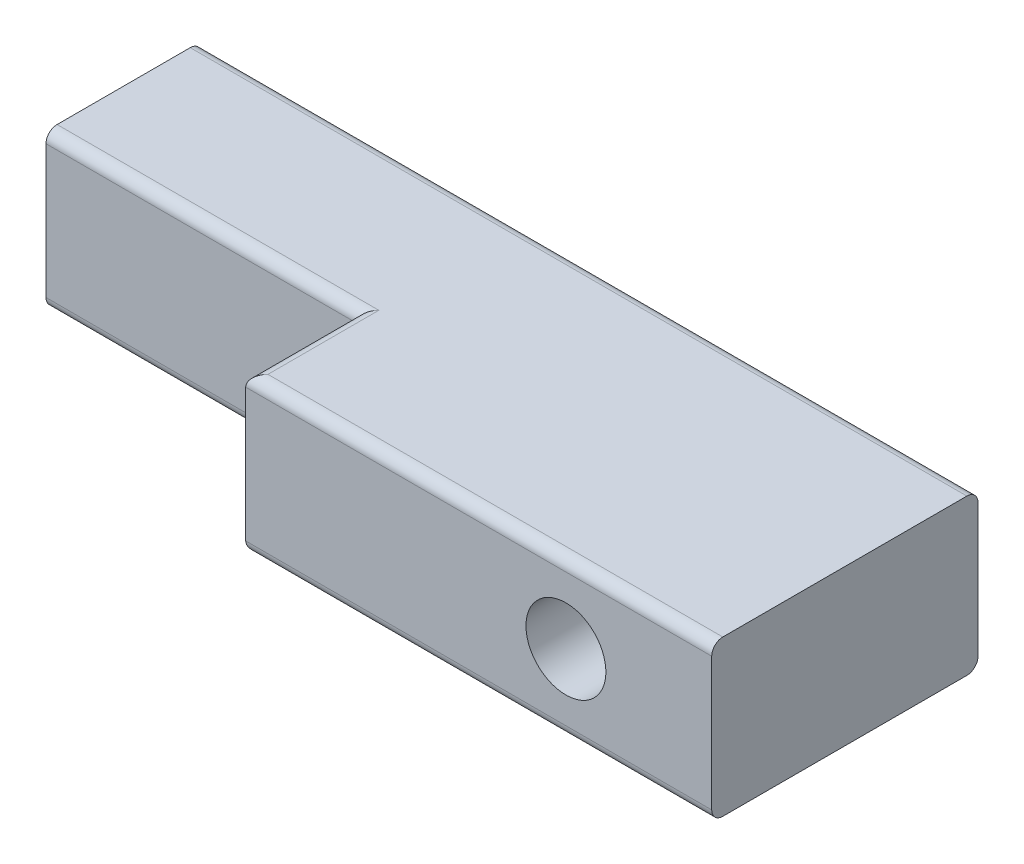
ISO-10303-21;
HEADER;
FILE_DESCRIPTION(('STEP AP214'),'2;1');
FILE_NAME('part.step','',(''),(''),'','','');
FILE_SCHEMA(('AUTOMOTIVE_DESIGN { 1 0 10303 214 1 1 1 1 }'));
ENDSEC;
DATA;
#1=APPLICATION_CONTEXT('core data for automotive mechanical design processes');
#2=APPLICATION_PROTOCOL_DEFINITION('international standard','automotive_design',2000,#1);
#3=PRODUCT_CONTEXT('',#1,'mechanical');
#4=PRODUCT('Part','Part','',(#3));
#5=PRODUCT_RELATED_PRODUCT_CATEGORY('part','',(#4));
#6=PRODUCT_DEFINITION_FORMATION('','',#4);
#7=PRODUCT_DEFINITION_CONTEXT('part definition',#1,'design');
#8=PRODUCT_DEFINITION('design','',#6,#7);
#9=PRODUCT_DEFINITION_SHAPE('','',#8);
#10=(LENGTH_UNIT() NAMED_UNIT(*) SI_UNIT(.MILLI.,.METRE.));
#11=(NAMED_UNIT(*) PLANE_ANGLE_UNIT() SI_UNIT($,.RADIAN.));
#12=(NAMED_UNIT(*) SI_UNIT($,.STERADIAN.) SOLID_ANGLE_UNIT());
#13=UNCERTAINTY_MEASURE_WITH_UNIT(LENGTH_MEASURE(1.E-05),#10,'distance_accuracy_value','');
#14=(GEOMETRIC_REPRESENTATION_CONTEXT(3) GLOBAL_UNCERTAINTY_ASSIGNED_CONTEXT((#13)) GLOBAL_UNIT_ASSIGNED_CONTEXT((#10,
#11,#12)) REPRESENTATION_CONTEXT('',''));
#15=CARTESIAN_POINT('',(0.,0.,0.));
#16=DIRECTION('',(0.,0.,1.));
#17=DIRECTION('',(1.,0.,0.));
#18=AXIS2_PLACEMENT_3D('',#15,#16,#17);
#19=CARTESIAN_POINT('',(0.,0.,7.));
#20=DIRECTION('',(0.,0.,-1.));
#21=DIRECTION('',(-1.,0.,0.));
#22=AXIS2_PLACEMENT_3D('',#19,#20,#21);
#23=PLANE('',#22);
#24=DIRECTION('',(0.,-1.,0.));
#25=VECTOR('',#24,1.);
#26=CARTESIAN_POINT('',(-17.5,-3.5,7.));
#27=LINE('',#26,#25);
#28=CARTESIAN_POINT('',(-17.5,3.,7.));
#29=VERTEX_POINT('',#28);
#30=CARTESIAN_POINT('',(-17.5,-3.,7.));
#31=VERTEX_POINT('',#30);
#32=EDGE_CURVE('E179',#29,#31,#27,.T.);
#33=ORIENTED_EDGE('',*,*,#32,.T.);
#34=DIRECTION('',(1.,0.,0.));
#35=VECTOR('',#34,1.);
#36=CARTESIAN_POINT('',(0.,-3.,7.));
#37=LINE('',#36,#35);
#38=CARTESIAN_POINT('',(-3.5,-3.,7.));
#39=VERTEX_POINT('',#38);
#40=EDGE_CURVE('E152',#31,#39,#37,.T.);
#41=ORIENTED_EDGE('',*,*,#40,.T.);
#42=DIRECTION('',(0.,-1.,0.));
#43=VECTOR('',#42,1.);
#44=CARTESIAN_POINT('',(-3.5,3.5,7.));
#45=LINE('',#44,#43);
#46=CARTESIAN_POINT('',(-3.5,3.,7.));
#47=VERTEX_POINT('',#46);
#48=EDGE_CURVE('E159',#47,#39,#45,.T.);
#49=ORIENTED_EDGE('',*,*,#48,.F.);
#50=DIRECTION('',(-1.,0.,0.));
#51=VECTOR('',#50,1.);
#52=CARTESIAN_POINT('',(0.,3.,7.));
#53=LINE('',#52,#51);
#54=EDGE_CURVE('E144',#47,#29,#53,.T.);
#55=ORIENTED_EDGE('',*,*,#54,.T.);
#56=EDGE_LOOP('',(#33,#41,#49,#55));
#57=FACE_BOUND('',#56,.T.);
#58=ADVANCED_FACE('F39',(#57),#23,.F.);
#59=CARTESIAN_POINT('',(17.5,-3.5,7.));
#60=DIRECTION('',(-1.,0.,0.));
#61=DIRECTION('',(0.,0.,1.));
#62=AXIS2_PLACEMENT_3D('',#59,#60,#61);
#63=PLANE('',#62);
#64=DIRECTION('',(0.,1.,0.));
#65=VECTOR('',#64,1.);
#66=CARTESIAN_POINT('',(17.5,3.5,12.));
#67=LINE('',#66,#65);
#68=CARTESIAN_POINT('',(17.5,-3.,12.));
#69=VERTEX_POINT('',#68);
#70=CARTESIAN_POINT('',(17.5,3.,12.));
#71=VERTEX_POINT('',#70);
#72=EDGE_CURVE('E170',#69,#71,#67,.T.);
#73=ORIENTED_EDGE('',*,*,#72,.F.);
#74=CARTESIAN_POINT('',(17.5,-3.,11.5));
#75=DIRECTION('',(-1.,0.,0.));
#76=DIRECTION('',(0.,0.,1.));
#77=AXIS2_PLACEMENT_3D('',#74,#75,#76);
#78=CIRCLE('',#77,0.5);
#79=CARTESIAN_POINT('',(17.5,-3.5,11.5));
#80=VERTEX_POINT('',#79);
#81=EDGE_CURVE('E257',#69,#80,#78,.F.);
#82=ORIENTED_EDGE('',*,*,#81,.T.);
#83=DIRECTION('',(0.,0.,-1.));
#84=VECTOR('',#83,1.);
#85=CARTESIAN_POINT('',(17.5,-3.5,7.));
#86=LINE('',#85,#84);
#87=CARTESIAN_POINT('',(17.5,-3.5,0.5));
#88=VERTEX_POINT('',#87);
#89=EDGE_CURVE('E182',#80,#88,#86,.T.);
#90=ORIENTED_EDGE('',*,*,#89,.T.);
#91=CARTESIAN_POINT('',(17.5,-3.,0.5));
#92=DIRECTION('',(-1.,0.,0.));
#93=DIRECTION('',(0.,0.,1.));
#94=AXIS2_PLACEMENT_3D('',#91,#92,#93);
#95=CIRCLE('',#94,0.5);
#96=CARTESIAN_POINT('',(17.5,-3.,0.));
#97=VERTEX_POINT('',#96);
#98=EDGE_CURVE('E63',#88,#97,#95,.F.);
#99=ORIENTED_EDGE('',*,*,#98,.T.);
#100=DIRECTION('',(0.,1.,0.));
#101=VECTOR('',#100,1.);
#102=CARTESIAN_POINT('',(17.5,-3.5,0.));
#103=LINE('',#102,#101);
#104=CARTESIAN_POINT('',(17.5,3.,0.));
#105=VERTEX_POINT('',#104);
#106=EDGE_CURVE('E184',#97,#105,#103,.T.);
#107=ORIENTED_EDGE('',*,*,#106,.T.);
#108=CARTESIAN_POINT('',(17.5,3.,0.5));
#109=DIRECTION('',(-1.,0.,0.));
#110=DIRECTION('',(0.,0.,1.));
#111=AXIS2_PLACEMENT_3D('',#108,#109,#110);
#112=CIRCLE('',#111,0.5);
#113=CARTESIAN_POINT('',(17.5,3.5,0.5));
#114=VERTEX_POINT('',#113);
#115=EDGE_CURVE('E249',#105,#114,#112,.F.);
#116=ORIENTED_EDGE('',*,*,#115,.T.);
#117=DIRECTION('',(0.,0.,-1.));
#118=VECTOR('',#117,1.);
#119=CARTESIAN_POINT('',(17.5,3.5,7.));
#120=LINE('',#119,#118);
#121=CARTESIAN_POINT('',(17.5,3.5,11.5));
#122=VERTEX_POINT('',#121);
#123=EDGE_CURVE('E200',#122,#114,#120,.T.);
#124=ORIENTED_EDGE('',*,*,#123,.F.);
#125=CARTESIAN_POINT('',(17.5,3.,11.5));
#126=DIRECTION('',(-1.,0.,0.));
#127=DIRECTION('',(0.,0.,1.));
#128=AXIS2_PLACEMENT_3D('',#125,#126,#127);
#129=CIRCLE('',#128,0.5);
#130=EDGE_CURVE('E254',#122,#71,#129,.F.);
#131=ORIENTED_EDGE('',*,*,#130,.T.);
#132=EDGE_LOOP('',(#73,#82,#90,#99,#107,#116,#124,#131));
#133=FACE_BOUND('',#132,.T.);
#134=ADVANCED_FACE('F308',(#133),#63,.F.);
#135=CARTESIAN_POINT('',(-17.5,3.5,7.));
#136=DIRECTION('',(0.,-1.,0.));
#137=DIRECTION('',(0.,0.,-1.));
#138=AXIS2_PLACEMENT_3D('',#135,#136,#137);
#139=PLANE('',#138);
#140=DIRECTION('',(0.,0.,-1.));
#141=VECTOR('',#140,1.);
#142=CARTESIAN_POINT('',(-17.5,3.5,7.));
#143=LINE('',#142,#141);
#144=CARTESIAN_POINT('',(-17.5,3.5,6.5));
#145=VERTEX_POINT('',#144);
#146=CARTESIAN_POINT('',(-17.5,3.5,0.5));
#147=VERTEX_POINT('',#146);
#148=EDGE_CURVE('E196',#145,#147,#143,.T.);
#149=ORIENTED_EDGE('',*,*,#148,.F.);
#150=DIRECTION('',(-1.,0.,0.));
#151=VECTOR('',#150,1.);
#152=CARTESIAN_POINT('',(-17.5,3.5,6.5));
#153=LINE('',#152,#151);
#154=CARTESIAN_POINT('',(-3.,3.5,6.5));
#155=VERTEX_POINT('',#154);
#156=EDGE_CURVE('E214',#145,#155,#153,.F.);
#157=ORIENTED_EDGE('',*,*,#156,.T.);
#158=DIRECTION('',(0.,0.,-1.));
#159=VECTOR('',#158,1.);
#160=CARTESIAN_POINT('',(-3.,3.5,7.));
#161=LINE('',#160,#159);
#162=CARTESIAN_POINT('',(-3.,3.5,11.5));
#163=VERTEX_POINT('',#162);
#164=EDGE_CURVE('E137',#155,#163,#161,.F.);
#165=ORIENTED_EDGE('',*,*,#164,.T.);
#166=DIRECTION('',(-1.,0.,0.));
#167=VECTOR('',#166,1.);
#168=CARTESIAN_POINT('',(-17.5,3.5,11.5));
#169=LINE('',#168,#167);
#170=EDGE_CURVE('E209',#163,#122,#169,.F.);
#171=ORIENTED_EDGE('',*,*,#170,.T.);
#172=ORIENTED_EDGE('',*,*,#123,.T.);
#173=DIRECTION('',(-1.,0.,0.));
#174=VECTOR('',#173,1.);
#175=CARTESIAN_POINT('',(-17.5,3.5,0.5));
#176=LINE('',#175,#174);
#177=EDGE_CURVE('E165',#114,#147,#176,.T.);
#178=ORIENTED_EDGE('',*,*,#177,.T.);
#179=EDGE_LOOP('',(#149,#157,#165,#171,#172,#178));
#180=FACE_BOUND('',#179,.T.);
#181=ADVANCED_FACE('F303',(#180),#139,.F.);
#182=CARTESIAN_POINT('',(-17.5,-3.5,7.));
#183=DIRECTION('',(1.,0.,0.));
#184=DIRECTION('',(0.,0.,-1.));
#185=AXIS2_PLACEMENT_3D('',#182,#183,#184);
#186=PLANE('',#185);
#187=DIRECTION('',(0.,0.,-1.));
#188=VECTOR('',#187,1.);
#189=CARTESIAN_POINT('',(-17.5,-3.5,7.));
#190=LINE('',#189,#188);
#191=CARTESIAN_POINT('',(-17.5,-3.5,6.5));
#192=VERTEX_POINT('',#191);
#193=CARTESIAN_POINT('',(-17.5,-3.5,0.5));
#194=VERTEX_POINT('',#193);
#195=EDGE_CURVE('E192',#192,#194,#190,.T.);
#196=ORIENTED_EDGE('',*,*,#195,.F.);
#197=CARTESIAN_POINT('',(-17.5,-3.,6.5));
#198=DIRECTION('',(1.,0.,0.));
#199=DIRECTION('',(0.,0.,-1.));
#200=AXIS2_PLACEMENT_3D('',#197,#198,#199);
#201=CIRCLE('',#200,0.5);
#202=EDGE_CURVE('E240',#192,#31,#201,.F.);
#203=ORIENTED_EDGE('',*,*,#202,.T.);
#204=ORIENTED_EDGE('',*,*,#32,.F.);
#205=CARTESIAN_POINT('',(-17.5,3.,6.5));
#206=DIRECTION('',(1.,0.,0.));
#207=DIRECTION('',(0.,0.,-1.));
#208=AXIS2_PLACEMENT_3D('',#205,#206,#207);
#209=CIRCLE('',#208,0.5);
#210=EDGE_CURVE('E146',#29,#145,#209,.F.);
#211=ORIENTED_EDGE('',*,*,#210,.T.);
#212=ORIENTED_EDGE('',*,*,#148,.T.);
#213=CARTESIAN_POINT('',(-17.5,3.,0.5));
#214=DIRECTION('',(1.,0.,0.));
#215=DIRECTION('',(0.,0.,-1.));
#216=AXIS2_PLACEMENT_3D('',#213,#214,#215);
#217=CIRCLE('',#216,0.5);
#218=CARTESIAN_POINT('',(-17.5,3.,0.));
#219=VERTEX_POINT('',#218);
#220=EDGE_CURVE('E232',#147,#219,#217,.F.);
#221=ORIENTED_EDGE('',*,*,#220,.T.);
#222=DIRECTION('',(0.,-1.,0.));
#223=VECTOR('',#222,1.);
#224=CARTESIAN_POINT('',(-17.5,-3.5,0.));
#225=LINE('',#224,#223);
#226=CARTESIAN_POINT('',(-17.5,-3.,0.));
#227=VERTEX_POINT('',#226);
#228=EDGE_CURVE('E183',#219,#227,#225,.T.);
#229=ORIENTED_EDGE('',*,*,#228,.T.);
#230=CARTESIAN_POINT('',(-17.5,-3.,0.5));
#231=DIRECTION('',(1.,0.,0.));
#232=DIRECTION('',(0.,0.,-1.));
#233=AXIS2_PLACEMENT_3D('',#230,#231,#232);
#234=CIRCLE('',#233,0.5);
#235=EDGE_CURVE('E235',#227,#194,#234,.F.);
#236=ORIENTED_EDGE('',*,*,#235,.T.);
#237=EDGE_LOOP('',(#196,#203,#204,#211,#212,#221,#229,#236));
#238=FACE_BOUND('',#237,.T.);
#239=ADVANCED_FACE('F295',(#238),#186,.F.);
#240=CARTESIAN_POINT('',(-17.5,-3.5,7.));
#241=DIRECTION('',(0.,1.,0.));
#242=DIRECTION('',(0.,0.,1.));
#243=AXIS2_PLACEMENT_3D('',#240,#241,#242);
#244=PLANE('',#243);
#245=DIRECTION('',(0.,0.,-1.));
#246=VECTOR('',#245,1.);
#247=CARTESIAN_POINT('',(-3.,-3.5,7.));
#248=LINE('',#247,#246);
#249=CARTESIAN_POINT('',(-3.,-3.5,11.5));
#250=VERTEX_POINT('',#249);
#251=CARTESIAN_POINT('',(-3.,-3.5,6.5));
#252=VERTEX_POINT('',#251);
#253=EDGE_CURVE('E224',#250,#252,#248,.T.);
#254=ORIENTED_EDGE('',*,*,#253,.T.);
#255=DIRECTION('',(1.,0.,0.));
#256=VECTOR('',#255,1.);
#257=CARTESIAN_POINT('',(-17.5,-3.5,6.5));
#258=LINE('',#257,#256);
#259=EDGE_CURVE('E153',#252,#192,#258,.F.);
#260=ORIENTED_EDGE('',*,*,#259,.T.);
#261=ORIENTED_EDGE('',*,*,#195,.T.);
#262=DIRECTION('',(1.,0.,0.));
#263=VECTOR('',#262,1.);
#264=CARTESIAN_POINT('',(17.5,-3.5,0.5));
#265=LINE('',#264,#263);
#266=EDGE_CURVE('E217',#194,#88,#265,.T.);
#267=ORIENTED_EDGE('',*,*,#266,.T.);
#268=ORIENTED_EDGE('',*,*,#89,.F.);
#269=DIRECTION('',(1.,0.,0.));
#270=VECTOR('',#269,1.);
#271=CARTESIAN_POINT('',(-17.5,-3.5,11.5));
#272=LINE('',#271,#270);
#273=EDGE_CURVE('E221',#80,#250,#272,.F.);
#274=ORIENTED_EDGE('',*,*,#273,.T.);
#275=EDGE_LOOP('',(#254,#260,#261,#267,#268,#274));
#276=FACE_BOUND('',#275,.T.);
#277=ADVANCED_FACE('F285',(#276),#244,.F.);
#278=CARTESIAN_POINT('',(0.,0.,0.));
#279=DIRECTION('',(0.,0.,-1.));
#280=DIRECTION('',(-1.,0.,0.));
#281=AXIS2_PLACEMENT_3D('',#278,#279,#280);
#282=PLANE('',#281);
#283=CARTESIAN_POINT('',(10.9295931048964,0.,0.));
#284=DIRECTION('',(0.,0.,-1.));
#285=DIRECTION('',(-1.,0.,0.));
#286=AXIS2_PLACEMENT_3D('',#283,#284,#285);
#287=CIRCLE('',#286,1.8);
#288=CARTESIAN_POINT('',(9.12959310489643,0.,0.));
#289=VERTEX_POINT('',#288);
#290=EDGE_CURVE('E272',#289,#289,#287,.T.);
#291=ORIENTED_EDGE('',*,*,#290,.F.);
#292=EDGE_LOOP('',(#291));
#293=FACE_BOUND('',#292,.T.);
#294=ORIENTED_EDGE('',*,*,#106,.F.);
#295=DIRECTION('',(1.,0.,0.));
#296=VECTOR('',#295,1.);
#297=CARTESIAN_POINT('',(-17.5,-3.,0.));
#298=LINE('',#297,#296);
#299=EDGE_CURVE('E11',#97,#227,#298,.F.);
#300=ORIENTED_EDGE('',*,*,#299,.T.);
#301=ORIENTED_EDGE('',*,*,#228,.F.);
#302=DIRECTION('',(-1.,0.,0.));
#303=VECTOR('',#302,1.);
#304=CARTESIAN_POINT('',(17.5,3.,0.));
#305=LINE('',#304,#303);
#306=EDGE_CURVE('E49',#219,#105,#305,.F.);
#307=ORIENTED_EDGE('',*,*,#306,.T.);
#308=EDGE_LOOP('',(#294,#300,#301,#307));
#309=FACE_BOUND('',#308,.T.);
#310=ADVANCED_FACE('F283',(#293,#309),#282,.T.);
#311=CARTESIAN_POINT('',(-3.5,3.5,12.));
#312=DIRECTION('',(1.,0.,0.));
#313=DIRECTION('',(0.,0.,-1.));
#314=AXIS2_PLACEMENT_3D('',#311,#312,#313);
#315=PLANE('',#314);
#316=DIRECTION('',(0.,-1.,0.));
#317=VECTOR('',#316,1.);
#318=CARTESIAN_POINT('',(-3.5,3.5,12.));
#319=LINE('',#318,#317);
#320=CARTESIAN_POINT('',(-3.5,3.,12.));
#321=VERTEX_POINT('',#320);
#322=CARTESIAN_POINT('',(-3.5,-3.,12.));
#323=VERTEX_POINT('',#322);
#324=EDGE_CURVE('E162',#321,#323,#319,.T.);
#325=ORIENTED_EDGE('',*,*,#324,.F.);
#326=DIRECTION('',(0.,0.,-1.));
#327=VECTOR('',#326,1.);
#328=CARTESIAN_POINT('',(-3.5,3.,12.));
#329=LINE('',#328,#327);
#330=EDGE_CURVE('E136',#321,#47,#329,.T.);
#331=ORIENTED_EDGE('',*,*,#330,.T.);
#332=ORIENTED_EDGE('',*,*,#48,.T.);
#333=DIRECTION('',(0.,0.,-1.));
#334=VECTOR('',#333,1.);
#335=CARTESIAN_POINT('',(-3.5,-3.,12.));
#336=LINE('',#335,#334);
#337=EDGE_CURVE('E166',#39,#323,#336,.F.);
#338=ORIENTED_EDGE('',*,*,#337,.T.);
#339=EDGE_LOOP('',(#325,#331,#332,#338));
#340=FACE_BOUND('',#339,.T.);
#341=ADVANCED_FACE('F158',(#340),#315,.F.);
#342=CARTESIAN_POINT('',(0.,0.,12.));
#343=DIRECTION('',(0.,0.,-1.));
#344=DIRECTION('',(-1.,0.,0.));
#345=AXIS2_PLACEMENT_3D('',#342,#343,#344);
#346=PLANE('',#345);
#347=CARTESIAN_POINT('',(10.9295931048964,0.,12.));
#348=DIRECTION('',(0.,0.,-1.));
#349=DIRECTION('',(-1.,0.,0.));
#350=AXIS2_PLACEMENT_3D('',#347,#348,#349);
#351=CIRCLE('',#350,1.8);
#352=CARTESIAN_POINT('',(9.12959310489643,0.,12.));
#353=VERTEX_POINT('',#352);
#354=EDGE_CURVE('E263',#353,#353,#351,.T.);
#355=ORIENTED_EDGE('',*,*,#354,.T.);
#356=EDGE_LOOP('',(#355));
#357=FACE_BOUND('',#356,.T.);
#358=ORIENTED_EDGE('',*,*,#324,.T.);
#359=DIRECTION('',(1.,0.,0.));
#360=VECTOR('',#359,1.);
#361=CARTESIAN_POINT('',(0.,-3.,12.));
#362=LINE('',#361,#360);
#363=EDGE_CURVE('E246',#323,#69,#362,.T.);
#364=ORIENTED_EDGE('',*,*,#363,.T.);
#365=ORIENTED_EDGE('',*,*,#72,.T.);
#366=DIRECTION('',(-1.,0.,0.));
#367=VECTOR('',#366,1.);
#368=CARTESIAN_POINT('',(0.,3.,12.));
#369=LINE('',#368,#367);
#370=EDGE_CURVE('E243',#71,#321,#369,.T.);
#371=ORIENTED_EDGE('',*,*,#370,.T.);
#372=EDGE_LOOP('',(#358,#364,#365,#371));
#373=FACE_BOUND('',#372,.T.);
#374=ADVANCED_FACE('F315',(#357,#373),#346,.F.);
#375=CARTESIAN_POINT('',(0.,3.,11.5));
#376=DIRECTION('',(-1.,0.,0.));
#377=DIRECTION('',(0.,0.,1.));
#378=AXIS2_PLACEMENT_3D('',#375,#376,#377);
#379=CYLINDRICAL_SURFACE('',#378,0.5);
#380=ORIENTED_EDGE('',*,*,#130,.F.);
#381=ORIENTED_EDGE('',*,*,#170,.F.);
#382=CARTESIAN_POINT('',(-3.,3.,11.5));
#383=DIRECTION('',(-0.707106781186547,0.,-0.707106781186547));
#384=DIRECTION('',(-0.707106781186547,0.,0.707106781186547));
#385=AXIS2_PLACEMENT_3D('',#382,#383,#384);
#386=ELLIPSE('',#385,0.707106781186547,0.5);
#387=EDGE_CURVE('E141',#321,#163,#386,.T.);
#388=ORIENTED_EDGE('',*,*,#387,.F.);
#389=ORIENTED_EDGE('',*,*,#370,.F.);
#390=EDGE_LOOP('',(#380,#381,#388,#389));
#391=FACE_BOUND('',#390,.T.);
#392=ADVANCED_FACE('F313',(#391),#379,.T.);
#393=CARTESIAN_POINT('',(0.,3.,6.5));
#394=DIRECTION('',(-1.,0.,0.));
#395=DIRECTION('',(0.,0.,1.));
#396=AXIS2_PLACEMENT_3D('',#393,#394,#395);
#397=CYLINDRICAL_SURFACE('',#396,0.5);
#398=ORIENTED_EDGE('',*,*,#210,.F.);
#399=ORIENTED_EDGE('',*,*,#54,.F.);
#400=CARTESIAN_POINT('',(-3.,3.,6.5));
#401=DIRECTION('',(-0.707106781186547,0.,-0.707106781186547));
#402=DIRECTION('',(0.707106781186547,0.,-0.707106781186547));
#403=AXIS2_PLACEMENT_3D('',#400,#401,#402);
#404=ELLIPSE('',#403,0.707106781186547,0.5);
#405=EDGE_CURVE('E131',#155,#47,#404,.F.);
#406=ORIENTED_EDGE('',*,*,#405,.F.);
#407=ORIENTED_EDGE('',*,*,#156,.F.);
#408=EDGE_LOOP('',(#398,#399,#406,#407));
#409=FACE_BOUND('',#408,.T.);
#410=ADVANCED_FACE('F145',(#409),#397,.T.);
#411=CARTESIAN_POINT('',(-3.,3.,12.));
#412=DIRECTION('',(0.,0.,-1.));
#413=DIRECTION('',(-1.,0.,0.));
#414=AXIS2_PLACEMENT_3D('',#411,#412,#413);
#415=CYLINDRICAL_SURFACE('',#414,0.5);
#416=ORIENTED_EDGE('',*,*,#387,.T.);
#417=ORIENTED_EDGE('',*,*,#164,.F.);
#418=ORIENTED_EDGE('',*,*,#405,.T.);
#419=ORIENTED_EDGE('',*,*,#330,.F.);
#420=EDGE_LOOP('',(#416,#417,#418,#419));
#421=FACE_BOUND('',#420,.T.);
#422=ADVANCED_FACE('F134',(#421),#415,.T.);
#423=CARTESIAN_POINT('',(0.,-3.,11.5));
#424=DIRECTION('',(1.,0.,0.));
#425=DIRECTION('',(0.,0.,-1.));
#426=AXIS2_PLACEMENT_3D('',#423,#424,#425);
#427=CYLINDRICAL_SURFACE('',#426,0.5);
#428=ORIENTED_EDGE('',*,*,#81,.F.);
#429=ORIENTED_EDGE('',*,*,#363,.F.);
#430=CARTESIAN_POINT('',(-3.,-3.,11.5));
#431=DIRECTION('',(0.707106781186547,0.,0.707106781186547));
#432=DIRECTION('',(0.707106781186547,0.,-0.707106781186547));
#433=AXIS2_PLACEMENT_3D('',#430,#431,#432);
#434=ELLIPSE('',#433,0.707106781186547,0.5);
#435=EDGE_CURVE('E43',#250,#323,#434,.F.);
#436=ORIENTED_EDGE('',*,*,#435,.F.);
#437=ORIENTED_EDGE('',*,*,#273,.F.);
#438=EDGE_LOOP('',(#428,#429,#436,#437));
#439=FACE_BOUND('',#438,.T.);
#440=ADVANCED_FACE('F320',(#439),#427,.T.);
#441=CARTESIAN_POINT('',(0.,-3.,6.5));
#442=DIRECTION('',(1.,0.,0.));
#443=DIRECTION('',(0.,0.,-1.));
#444=AXIS2_PLACEMENT_3D('',#441,#442,#443);
#445=CYLINDRICAL_SURFACE('',#444,0.5);
#446=ORIENTED_EDGE('',*,*,#202,.F.);
#447=ORIENTED_EDGE('',*,*,#259,.F.);
#448=CARTESIAN_POINT('',(-3.,-3.,6.5));
#449=DIRECTION('',(-0.707106781186547,0.,-0.707106781186547));
#450=DIRECTION('',(0.707106781186547,0.,-0.707106781186547));
#451=AXIS2_PLACEMENT_3D('',#448,#449,#450);
#452=ELLIPSE('',#451,0.707106781186547,0.5);
#453=EDGE_CURVE('E261',#39,#252,#452,.F.);
#454=ORIENTED_EDGE('',*,*,#453,.F.);
#455=ORIENTED_EDGE('',*,*,#40,.F.);
#456=EDGE_LOOP('',(#446,#447,#454,#455));
#457=FACE_BOUND('',#456,.T.);
#458=ADVANCED_FACE('F300',(#457),#445,.T.);
#459=CARTESIAN_POINT('',(-3.,-3.,7.));
#460=DIRECTION('',(0.,0.,-1.));
#461=DIRECTION('',(-1.,0.,0.));
#462=AXIS2_PLACEMENT_3D('',#459,#460,#461);
#463=CYLINDRICAL_SURFACE('',#462,0.5);
#464=ORIENTED_EDGE('',*,*,#435,.T.);
#465=ORIENTED_EDGE('',*,*,#337,.F.);
#466=ORIENTED_EDGE('',*,*,#453,.T.);
#467=ORIENTED_EDGE('',*,*,#253,.F.);
#468=EDGE_LOOP('',(#464,#465,#466,#467));
#469=FACE_BOUND('',#468,.T.);
#470=ADVANCED_FACE('F322',(#469),#463,.T.);
#471=CARTESIAN_POINT('',(-17.5,-3.,0.5));
#472=DIRECTION('',(-1.,0.,0.));
#473=DIRECTION('',(0.,0.,1.));
#474=AXIS2_PLACEMENT_3D('',#471,#472,#473);
#475=CYLINDRICAL_SURFACE('',#474,0.5);
#476=ORIENTED_EDGE('',*,*,#235,.F.);
#477=ORIENTED_EDGE('',*,*,#299,.F.);
#478=ORIENTED_EDGE('',*,*,#98,.F.);
#479=ORIENTED_EDGE('',*,*,#266,.F.);
#480=EDGE_LOOP('',(#476,#477,#478,#479));
#481=FACE_BOUND('',#480,.T.);
#482=ADVANCED_FACE('F291',(#481),#475,.T.);
#483=CARTESIAN_POINT('',(-17.5,3.,0.5));
#484=DIRECTION('',(1.,0.,0.));
#485=DIRECTION('',(0.,0.,-1.));
#486=AXIS2_PLACEMENT_3D('',#483,#484,#485);
#487=CYLINDRICAL_SURFACE('',#486,0.5);
#488=ORIENTED_EDGE('',*,*,#115,.F.);
#489=ORIENTED_EDGE('',*,*,#306,.F.);
#490=ORIENTED_EDGE('',*,*,#220,.F.);
#491=ORIENTED_EDGE('',*,*,#177,.F.);
#492=EDGE_LOOP('',(#488,#489,#490,#491));
#493=FACE_BOUND('',#492,.T.);
#494=ADVANCED_FACE('F41',(#493),#487,.T.);
#495=CARTESIAN_POINT('',(10.9295931048964,0.,0.));
#496=DIRECTION('',(0.,0.,-1.));
#497=DIRECTION('',(-1.,0.,0.));
#498=AXIS2_PLACEMENT_3D('',#495,#496,#497);
#499=CYLINDRICAL_SURFACE('',#498,1.8);
#500=ORIENTED_EDGE('',*,*,#354,.F.);
#501=EDGE_LOOP('',(#500));
#502=FACE_BOUND('',#501,.T.);
#503=ORIENTED_EDGE('',*,*,#290,.T.);
#504=EDGE_LOOP('',(#503));
#505=FACE_BOUND('',#504,.T.);
#506=ADVANCED_FACE('F281',(#502,#505),#499,.F.);
#507=CLOSED_SHELL('',(#58,#134,#181,#239,#277,#310,#341,#374,#392,#410,#422,#440,#458,#470,#482,
#494,#506));
#508=MANIFOLD_SOLID_BREP('B2',#507);
#509=ADVANCED_BREP_SHAPE_REPRESENTATION('',(#18,#508),#14);
#510=SHAPE_DEFINITION_REPRESENTATION(#9,#509);
ENDSEC;
END-ISO-10303-21;
